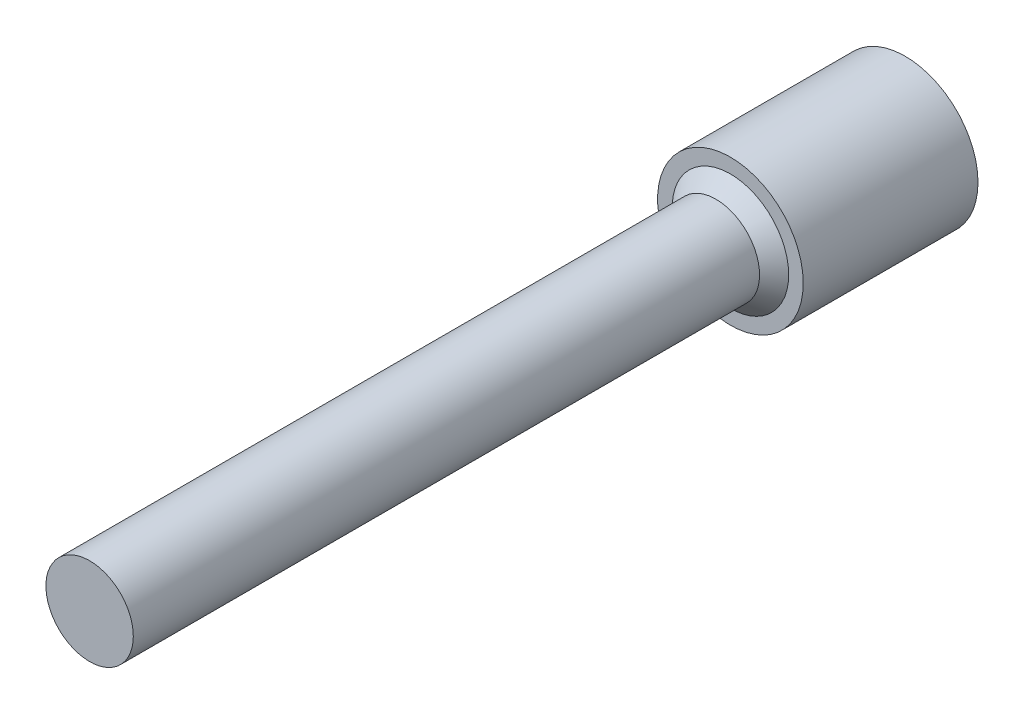
ISO-10303-21;
HEADER;
FILE_DESCRIPTION(('STEP AP214'),'2;1');
FILE_NAME('part.step','',(''),(''),'','','');
FILE_SCHEMA(('AUTOMOTIVE_DESIGN { 1 0 10303 214 1 1 1 1 }'));
ENDSEC;
DATA;
#1=APPLICATION_CONTEXT('core data for automotive mechanical design processes');
#2=APPLICATION_PROTOCOL_DEFINITION('international standard','automotive_design',2000,#1);
#3=PRODUCT_CONTEXT('',#1,'mechanical');
#4=PRODUCT('Part','Part','',(#3));
#5=PRODUCT_RELATED_PRODUCT_CATEGORY('part','',(#4));
#6=PRODUCT_DEFINITION_FORMATION('','',#4);
#7=PRODUCT_DEFINITION_CONTEXT('part definition',#1,'design');
#8=PRODUCT_DEFINITION('design','',#6,#7);
#9=PRODUCT_DEFINITION_SHAPE('','',#8);
#10=(LENGTH_UNIT() NAMED_UNIT(*) SI_UNIT(.MILLI.,.METRE.));
#11=(NAMED_UNIT(*) PLANE_ANGLE_UNIT() SI_UNIT($,.RADIAN.));
#12=(NAMED_UNIT(*) SI_UNIT($,.STERADIAN.) SOLID_ANGLE_UNIT());
#13=UNCERTAINTY_MEASURE_WITH_UNIT(LENGTH_MEASURE(1.E-05),#10,'distance_accuracy_value','');
#14=(GEOMETRIC_REPRESENTATION_CONTEXT(3) GLOBAL_UNCERTAINTY_ASSIGNED_CONTEXT((#13)) GLOBAL_UNIT_ASSIGNED_CONTEXT((#10,
#11,#12)) REPRESENTATION_CONTEXT('',''));
#15=CARTESIAN_POINT('',(0.,0.,0.));
#16=DIRECTION('',(0.,0.,1.));
#17=DIRECTION('',(1.,0.,0.));
#18=AXIS2_PLACEMENT_3D('',#15,#16,#17);
#19=CARTESIAN_POINT('',(0.,0.,6.));
#20=DIRECTION('',(0.,0.,-1.));
#21=DIRECTION('',(-1.,0.,0.));
#22=AXIS2_PLACEMENT_3D('',#19,#20,#21);
#23=CYLINDRICAL_SURFACE('',#22,2.5);
#24=CARTESIAN_POINT('',(0.,0.,6.));
#25=DIRECTION('',(0.,0.,1.));
#26=DIRECTION('',(1.,0.,0.));
#27=AXIS2_PLACEMENT_3D('',#24,#25,#26);
#28=CIRCLE('',#27,2.5);
#29=CARTESIAN_POINT('',(2.5,0.,6.));
#30=VERTEX_POINT('',#29);
#31=EDGE_CURVE('E144',#30,#30,#28,.T.);
#32=ORIENTED_EDGE('',*,*,#31,.F.);
#33=EDGE_LOOP('',(#32));
#34=FACE_BOUND('',#33,.T.);
#35=CARTESIAN_POINT('',(0.,0.,0.));
#36=DIRECTION('',(0.,0.,1.));
#37=DIRECTION('',(1.,0.,0.));
#38=AXIS2_PLACEMENT_3D('',#35,#36,#37);
#39=CIRCLE('',#38,2.5);
#40=CARTESIAN_POINT('',(2.5,0.,0.));
#41=VERTEX_POINT('',#40);
#42=EDGE_CURVE('E143',#41,#41,#39,.T.);
#43=ORIENTED_EDGE('',*,*,#42,.T.);
#44=EDGE_LOOP('',(#43));
#45=FACE_BOUND('',#44,.T.);
#46=ADVANCED_FACE('F33',(#34,#45),#23,.T.);
#47=CARTESIAN_POINT('',(0.,0.,6.));
#48=DIRECTION('',(0.,0.,1.));
#49=DIRECTION('',(1.,0.,0.));
#50=AXIS2_PLACEMENT_3D('',#47,#48,#49);
#51=PLANE('',#50);
#52=CARTESIAN_POINT('',(0.,0.,6.));
#53=DIRECTION('',(0.,0.,1.));
#54=DIRECTION('',(1.,0.,0.));
#55=AXIS2_PLACEMENT_3D('',#52,#53,#54);
#56=CIRCLE('',#55,1.99999999999999);
#57=CARTESIAN_POINT('',(1.99999999999999,0.,6.));
#58=VERTEX_POINT('',#57);
#59=EDGE_CURVE('E11',#58,#58,#56,.F.);
#60=ORIENTED_EDGE('',*,*,#59,.T.);
#61=EDGE_LOOP('',(#60));
#62=FACE_BOUND('',#61,.T.);
#63=ORIENTED_EDGE('',*,*,#31,.T.);
#64=EDGE_LOOP('',(#63));
#65=FACE_BOUND('',#64,.T.);
#66=ADVANCED_FACE('F163',(#62,#65),#51,.T.);
#67=CARTESIAN_POINT('',(0.,0.,0.));
#68=DIRECTION('',(0.,0.,1.));
#69=DIRECTION('',(1.,0.,0.));
#70=AXIS2_PLACEMENT_3D('',#67,#68,#69);
#71=PLANE('',#70);
#72=DIRECTION('',(0.866025403784438,-0.5,0.));
#73=VECTOR('',#72,1.);
#74=CARTESIAN_POINT('',(0.,1.,0.));
#75=LINE('',#74,#73);
#76=CARTESIAN_POINT('',(0.,1.,0.));
#77=VERTEX_POINT('',#76);
#78=CARTESIAN_POINT('',(0.866025403784439,0.5,0.));
#79=VERTEX_POINT('',#78);
#80=EDGE_CURVE('E122',#77,#79,#75,.T.);
#81=ORIENTED_EDGE('',*,*,#80,.F.);
#82=DIRECTION('',(0.866025403784439,0.5,0.));
#83=VECTOR('',#82,1.);
#84=CARTESIAN_POINT('',(-0.866025403784439,0.500000000000001,0.));
#85=LINE('',#84,#83);
#86=CARTESIAN_POINT('',(-0.866025403784439,0.500000000000001,0.));
#87=VERTEX_POINT('',#86);
#88=EDGE_CURVE('E48',#87,#77,#85,.T.);
#89=ORIENTED_EDGE('',*,*,#88,.F.);
#90=DIRECTION('',(0.,1.,0.));
#91=VECTOR('',#90,1.);
#92=CARTESIAN_POINT('',(-0.866025403784439,-0.500000000000001,0.));
#93=LINE('',#92,#91);
#94=CARTESIAN_POINT('',(-0.866025403784439,-0.500000000000001,0.));
#95=VERTEX_POINT('',#94);
#96=EDGE_CURVE('E131',#95,#87,#93,.T.);
#97=ORIENTED_EDGE('',*,*,#96,.F.);
#98=DIRECTION('',(-0.866025403784439,0.5,0.));
#99=VECTOR('',#98,1.);
#100=CARTESIAN_POINT('',(0.,-1.,0.));
#101=LINE('',#100,#99);
#102=CARTESIAN_POINT('',(0.,-1.,0.));
#103=VERTEX_POINT('',#102);
#104=EDGE_CURVE('E129',#103,#95,#101,.T.);
#105=ORIENTED_EDGE('',*,*,#104,.F.);
#106=DIRECTION('',(-0.866025403784439,-0.5,0.));
#107=VECTOR('',#106,1.);
#108=CARTESIAN_POINT('',(0.866025403784439,-0.500000000000001,0.));
#109=LINE('',#108,#107);
#110=CARTESIAN_POINT('',(0.866025403784439,-0.500000000000001,0.));
#111=VERTEX_POINT('',#110);
#112=EDGE_CURVE('E96',#111,#103,#109,.T.);
#113=ORIENTED_EDGE('',*,*,#112,.F.);
#114=DIRECTION('',(0.,-1.,0.));
#115=VECTOR('',#114,1.);
#116=CARTESIAN_POINT('',(0.866025403784439,0.5,0.));
#117=LINE('',#116,#115);
#118=EDGE_CURVE('E125',#79,#111,#117,.T.);
#119=ORIENTED_EDGE('',*,*,#118,.F.);
#120=EDGE_LOOP('',(#81,#89,#97,#105,#113,#119));
#121=FACE_BOUND('',#120,.T.);
#122=ORIENTED_EDGE('',*,*,#42,.F.);
#123=EDGE_LOOP('',(#122));
#124=FACE_BOUND('',#123,.T.);
#125=ADVANCED_FACE('F168',(#121,#124),#71,.F.);
#126=CARTESIAN_POINT('',(0.,0.,28.));
#127=DIRECTION('',(0.,0.,-1.));
#128=DIRECTION('',(-1.,0.,0.));
#129=AXIS2_PLACEMENT_3D('',#126,#127,#128);
#130=CYLINDRICAL_SURFACE('',#129,1.5);
#131=CARTESIAN_POINT('',(0.,0.,6.5));
#132=DIRECTION('',(0.,0.,1.));
#133=DIRECTION('',(1.,0.,0.));
#134=AXIS2_PLACEMENT_3D('',#131,#132,#133);
#135=CIRCLE('',#134,1.5);
#136=CARTESIAN_POINT('',(1.5,0.,6.5));
#137=VERTEX_POINT('',#136);
#138=EDGE_CURVE('E41',#137,#137,#135,.T.);
#139=ORIENTED_EDGE('',*,*,#138,.T.);
#140=EDGE_LOOP('',(#139));
#141=FACE_BOUND('',#140,.T.);
#142=CARTESIAN_POINT('',(0.,0.,28.));
#143=DIRECTION('',(0.,0.,1.));
#144=DIRECTION('',(1.,0.,0.));
#145=AXIS2_PLACEMENT_3D('',#142,#143,#144);
#146=CIRCLE('',#145,1.5);
#147=CARTESIAN_POINT('',(1.5,0.,28.));
#148=VERTEX_POINT('',#147);
#149=EDGE_CURVE('E135',#148,#148,#146,.T.);
#150=ORIENTED_EDGE('',*,*,#149,.F.);
#151=EDGE_LOOP('',(#150));
#152=FACE_BOUND('',#151,.T.);
#153=ADVANCED_FACE('F151',(#141,#152),#130,.T.);
#154=CARTESIAN_POINT('',(0.,0.,28.));
#155=DIRECTION('',(0.,0.,1.));
#156=DIRECTION('',(1.,0.,0.));
#157=AXIS2_PLACEMENT_3D('',#154,#155,#156);
#158=PLANE('',#157);
#159=ORIENTED_EDGE('',*,*,#149,.T.);
#160=EDGE_LOOP('',(#159));
#161=FACE_BOUND('',#160,.T.);
#162=ADVANCED_FACE('F179',(#161),#158,.T.);
#163=CARTESIAN_POINT('',(-0.866025403784439,0.500000000000001,1.));
#164=DIRECTION('',(-0.5,0.866025403784439,0.));
#165=DIRECTION('',(-0.866025403784439,-0.5,0.));
#166=AXIS2_PLACEMENT_3D('',#163,#164,#165);
#167=PLANE('',#166);
#168=ORIENTED_EDGE('',*,*,#88,.T.);
#169=DIRECTION('',(0.,0.,-1.));
#170=VECTOR('',#169,1.);
#171=CARTESIAN_POINT('',(0.,1.,1.));
#172=LINE('',#171,#170);
#173=CARTESIAN_POINT('',(0.,1.,1.));
#174=VERTEX_POINT('',#173);
#175=EDGE_CURVE('E78',#174,#77,#172,.T.);
#176=ORIENTED_EDGE('',*,*,#175,.F.);
#177=DIRECTION('',(0.866025403784439,0.5,0.));
#178=VECTOR('',#177,1.);
#179=CARTESIAN_POINT('',(-0.866025403784439,0.500000000000001,1.));
#180=LINE('',#179,#178);
#181=CARTESIAN_POINT('',(-0.866025403784439,0.500000000000001,1.));
#182=VERTEX_POINT('',#181);
#183=EDGE_CURVE('E133',#182,#174,#180,.T.);
#184=ORIENTED_EDGE('',*,*,#183,.F.);
#185=DIRECTION('',(0.,0.,-1.));
#186=VECTOR('',#185,1.);
#187=CARTESIAN_POINT('',(-0.866025403784439,0.500000000000001,1.));
#188=LINE('',#187,#186);
#189=EDGE_CURVE('E56',#182,#87,#188,.T.);
#190=ORIENTED_EDGE('',*,*,#189,.T.);
#191=EDGE_LOOP('',(#168,#176,#184,#190));
#192=FACE_BOUND('',#191,.T.);
#193=ADVANCED_FACE('F182',(#192),#167,.F.);
#194=CARTESIAN_POINT('',(-0.866025403784439,-0.500000000000001,1.));
#195=DIRECTION('',(-1.,0.,0.));
#196=DIRECTION('',(0.,-1.,0.));
#197=AXIS2_PLACEMENT_3D('',#194,#195,#196);
#198=PLANE('',#197);
#199=ORIENTED_EDGE('',*,*,#96,.T.);
#200=ORIENTED_EDGE('',*,*,#189,.F.);
#201=DIRECTION('',(0.,1.,0.));
#202=VECTOR('',#201,1.);
#203=CARTESIAN_POINT('',(-0.866025403784439,-0.500000000000001,1.));
#204=LINE('',#203,#202);
#205=CARTESIAN_POINT('',(-0.866025403784439,-0.500000000000001,1.));
#206=VERTEX_POINT('',#205);
#207=EDGE_CURVE('E108',#206,#182,#204,.T.);
#208=ORIENTED_EDGE('',*,*,#207,.F.);
#209=DIRECTION('',(0.,0.,-1.));
#210=VECTOR('',#209,1.);
#211=CARTESIAN_POINT('',(-0.866025403784439,-0.500000000000001,1.));
#212=LINE('',#211,#210);
#213=EDGE_CURVE('E100',#206,#95,#212,.T.);
#214=ORIENTED_EDGE('',*,*,#213,.T.);
#215=EDGE_LOOP('',(#199,#200,#208,#214));
#216=FACE_BOUND('',#215,.T.);
#217=ADVANCED_FACE('F186',(#216),#198,.F.);
#218=CARTESIAN_POINT('',(0.,-1.,1.));
#219=DIRECTION('',(-0.5,-0.866025403784439,0.));
#220=DIRECTION('',(0.866025403784439,-0.5,0.));
#221=AXIS2_PLACEMENT_3D('',#218,#219,#220);
#222=PLANE('',#221);
#223=ORIENTED_EDGE('',*,*,#104,.T.);
#224=ORIENTED_EDGE('',*,*,#213,.F.);
#225=DIRECTION('',(-0.866025403784439,0.5,0.));
#226=VECTOR('',#225,1.);
#227=CARTESIAN_POINT('',(0.,-1.,1.));
#228=LINE('',#227,#226);
#229=CARTESIAN_POINT('',(0.,-1.,1.));
#230=VERTEX_POINT('',#229);
#231=EDGE_CURVE('E104',#230,#206,#228,.T.);
#232=ORIENTED_EDGE('',*,*,#231,.F.);
#233=DIRECTION('',(0.,0.,-1.));
#234=VECTOR('',#233,1.);
#235=CARTESIAN_POINT('',(0.,-1.,1.));
#236=LINE('',#235,#234);
#237=EDGE_CURVE('E89',#230,#103,#236,.T.);
#238=ORIENTED_EDGE('',*,*,#237,.T.);
#239=EDGE_LOOP('',(#223,#224,#232,#238));
#240=FACE_BOUND('',#239,.T.);
#241=ADVANCED_FACE('F105',(#240),#222,.F.);
#242=CARTESIAN_POINT('',(0.866025403784439,-0.500000000000001,1.));
#243=DIRECTION('',(0.5,-0.866025403784439,0.));
#244=DIRECTION('',(0.866025403784439,0.5,0.));
#245=AXIS2_PLACEMENT_3D('',#242,#243,#244);
#246=PLANE('',#245);
#247=ORIENTED_EDGE('',*,*,#112,.T.);
#248=ORIENTED_EDGE('',*,*,#237,.F.);
#249=DIRECTION('',(-0.866025403784439,-0.5,0.));
#250=VECTOR('',#249,1.);
#251=CARTESIAN_POINT('',(0.866025403784439,-0.500000000000001,1.));
#252=LINE('',#251,#250);
#253=CARTESIAN_POINT('',(0.866025403784439,-0.500000000000001,1.));
#254=VERTEX_POINT('',#253);
#255=EDGE_CURVE('E93',#254,#230,#252,.T.);
#256=ORIENTED_EDGE('',*,*,#255,.F.);
#257=DIRECTION('',(0.,0.,-1.));
#258=VECTOR('',#257,1.);
#259=CARTESIAN_POINT('',(0.866025403784439,-0.500000000000001,1.));
#260=LINE('',#259,#258);
#261=EDGE_CURVE('E101',#254,#111,#260,.T.);
#262=ORIENTED_EDGE('',*,*,#261,.T.);
#263=EDGE_LOOP('',(#247,#248,#256,#262));
#264=FACE_BOUND('',#263,.T.);
#265=ADVANCED_FACE('F91',(#264),#246,.F.);
#266=CARTESIAN_POINT('',(0.866025403784439,0.5,1.));
#267=DIRECTION('',(1.,0.,0.));
#268=DIRECTION('',(0.,1.,0.));
#269=AXIS2_PLACEMENT_3D('',#266,#267,#268);
#270=PLANE('',#269);
#271=ORIENTED_EDGE('',*,*,#118,.T.);
#272=ORIENTED_EDGE('',*,*,#261,.F.);
#273=DIRECTION('',(0.,-1.,0.));
#274=VECTOR('',#273,1.);
#275=CARTESIAN_POINT('',(0.866025403784439,0.5,1.));
#276=LINE('',#275,#274);
#277=CARTESIAN_POINT('',(0.866025403784439,0.5,1.));
#278=VERTEX_POINT('',#277);
#279=EDGE_CURVE('E114',#278,#254,#276,.T.);
#280=ORIENTED_EDGE('',*,*,#279,.F.);
#281=DIRECTION('',(0.,0.,-1.));
#282=VECTOR('',#281,1.);
#283=CARTESIAN_POINT('',(0.866025403784439,0.5,1.));
#284=LINE('',#283,#282);
#285=EDGE_CURVE('E138',#278,#79,#284,.T.);
#286=ORIENTED_EDGE('',*,*,#285,.T.);
#287=EDGE_LOOP('',(#271,#272,#280,#286));
#288=FACE_BOUND('',#287,.T.);
#289=ADVANCED_FACE('F189',(#288),#270,.F.);
#290=CARTESIAN_POINT('',(0.,1.,1.));
#291=DIRECTION('',(0.5,0.866025403784438,0.));
#292=DIRECTION('',(-0.866025403784439,0.5,0.));
#293=AXIS2_PLACEMENT_3D('',#290,#291,#292);
#294=PLANE('',#293);
#295=ORIENTED_EDGE('',*,*,#80,.T.);
#296=ORIENTED_EDGE('',*,*,#285,.F.);
#297=DIRECTION('',(0.866025403784438,-0.5,0.));
#298=VECTOR('',#297,1.);
#299=CARTESIAN_POINT('',(0.,1.,1.));
#300=LINE('',#299,#298);
#301=EDGE_CURVE('E116',#174,#278,#300,.T.);
#302=ORIENTED_EDGE('',*,*,#301,.F.);
#303=ORIENTED_EDGE('',*,*,#175,.T.);
#304=EDGE_LOOP('',(#295,#296,#302,#303));
#305=FACE_BOUND('',#304,.T.);
#306=ADVANCED_FACE('F159',(#305),#294,.F.);
#307=CARTESIAN_POINT('',(0.,0.,1.));
#308=DIRECTION('',(0.,0.,-1.));
#309=DIRECTION('',(-1.,0.,0.));
#310=AXIS2_PLACEMENT_3D('',#307,#308,#309);
#311=PLANE('',#310);
#312=ORIENTED_EDGE('',*,*,#183,.T.);
#313=ORIENTED_EDGE('',*,*,#301,.T.);
#314=ORIENTED_EDGE('',*,*,#279,.T.);
#315=ORIENTED_EDGE('',*,*,#255,.T.);
#316=ORIENTED_EDGE('',*,*,#231,.T.);
#317=ORIENTED_EDGE('',*,*,#207,.T.);
#318=EDGE_LOOP('',(#312,#313,#314,#315,#316,#317));
#319=FACE_BOUND('',#318,.T.);
#320=ADVANCED_FACE('F111',(#319),#311,.T.);
#321=CARTESIAN_POINT('',(0.,0.,6.5));
#322=DIRECTION('',(0.,0.,-1.));
#323=DIRECTION('',(-1.,0.,0.));
#324=AXIS2_PLACEMENT_3D('',#321,#322,#323);
#325=CONICAL_SURFACE('',#324,1.5,0.785398163397439);
#326=ORIENTED_EDGE('',*,*,#59,.F.);
#327=EDGE_LOOP('',(#326));
#328=FACE_BOUND('',#327,.T.);
#329=ORIENTED_EDGE('',*,*,#138,.F.);
#330=EDGE_LOOP('',(#329));
#331=FACE_BOUND('',#330,.T.);
#332=ADVANCED_FACE('F35',(#328,#331),#325,.T.);
#333=CLOSED_SHELL('',(#46,#66,#125,#153,#162,#193,#217,#241,#265,#289,#306,#320,#332));
#334=MANIFOLD_SOLID_BREP('B2',#333);
#335=ADVANCED_BREP_SHAPE_REPRESENTATION('',(#18,#334),#14);
#336=SHAPE_DEFINITION_REPRESENTATION(#9,#335);
ENDSEC;
END-ISO-10303-21;
